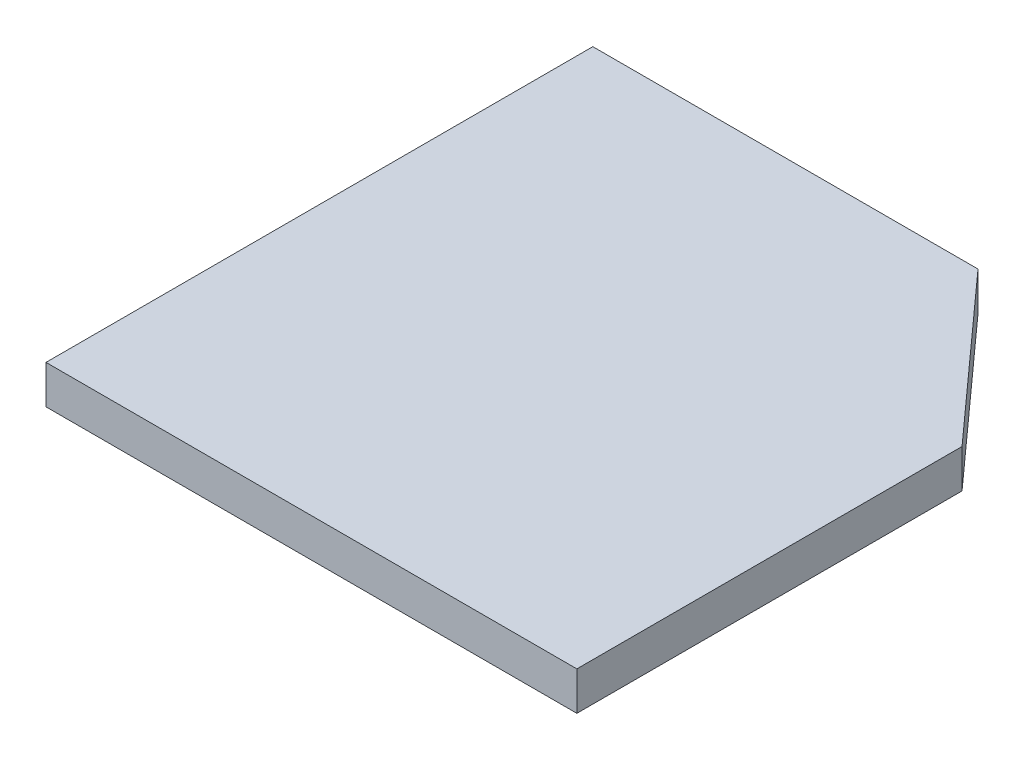
ISO-10303-21;
HEADER;
FILE_DESCRIPTION(('STEP AP214'),'2;1');
FILE_NAME('part.step','',(''),(''),'','','');
FILE_SCHEMA(('AUTOMOTIVE_DESIGN { 1 0 10303 214 1 1 1 1 }'));
ENDSEC;
DATA;
#1=APPLICATION_CONTEXT('core data for automotive mechanical design processes');
#2=APPLICATION_PROTOCOL_DEFINITION('international standard','automotive_design',2000,#1);
#3=PRODUCT_CONTEXT('',#1,'mechanical');
#4=PRODUCT('Part','Part','',(#3));
#5=PRODUCT_RELATED_PRODUCT_CATEGORY('part','',(#4));
#6=PRODUCT_DEFINITION_FORMATION('','',#4);
#7=PRODUCT_DEFINITION_CONTEXT('part definition',#1,'design');
#8=PRODUCT_DEFINITION('design','',#6,#7);
#9=PRODUCT_DEFINITION_SHAPE('','',#8);
#10=(LENGTH_UNIT() NAMED_UNIT(*) SI_UNIT(.MILLI.,.METRE.));
#11=(NAMED_UNIT(*) PLANE_ANGLE_UNIT() SI_UNIT($,.RADIAN.));
#12=(NAMED_UNIT(*) SI_UNIT($,.STERADIAN.) SOLID_ANGLE_UNIT());
#13=UNCERTAINTY_MEASURE_WITH_UNIT(LENGTH_MEASURE(1.E-05),#10,'distance_accuracy_value','');
#14=(GEOMETRIC_REPRESENTATION_CONTEXT(3) GLOBAL_UNCERTAINTY_ASSIGNED_CONTEXT((#13)) GLOBAL_UNIT_ASSIGNED_CONTEXT((#10,
#11,#12)) REPRESENTATION_CONTEXT('',''));
#15=CARTESIAN_POINT('',(0.,0.,0.));
#16=DIRECTION('',(0.,0.,1.));
#17=DIRECTION('',(1.,0.,0.));
#18=AXIS2_PLACEMENT_3D('',#15,#16,#17);
#19=CARTESIAN_POINT('',(0.,5.,0.));
#20=DIRECTION('',(1.,0.,0.));
#21=DIRECTION('',(0.,0.,-1.));
#22=AXIS2_PLACEMENT_3D('',#19,#20,#21);
#23=PLANE('',#22);
#24=DIRECTION('',(0.,0.,1.));
#25=VECTOR('',#24,1.);
#26=CARTESIAN_POINT('',(0.,0.,0.));
#27=LINE('',#26,#25);
#28=CARTESIAN_POINT('',(0.,0.,-70.9876663776316));
#29=VERTEX_POINT('',#28);
#30=CARTESIAN_POINT('',(0.,0.,0.));
#31=VERTEX_POINT('',#30);
#32=EDGE_CURVE('E119',#29,#31,#27,.T.);
#33=ORIENTED_EDGE('',*,*,#32,.T.);
#34=DIRECTION('',(0.,-1.,0.));
#35=VECTOR('',#34,1.);
#36=CARTESIAN_POINT('',(0.,5.,0.));
#37=LINE('',#36,#35);
#38=CARTESIAN_POINT('',(0.,5.,0.));
#39=VERTEX_POINT('',#38);
#40=EDGE_CURVE('E11',#39,#31,#37,.T.);
#41=ORIENTED_EDGE('',*,*,#40,.F.);
#42=DIRECTION('',(0.,0.,1.));
#43=VECTOR('',#42,1.);
#44=CARTESIAN_POINT('',(0.,5.,0.));
#45=LINE('',#44,#43);
#46=CARTESIAN_POINT('',(0.,5.,-70.9876663776316));
#47=VERTEX_POINT('',#46);
#48=EDGE_CURVE('E112',#47,#39,#45,.T.);
#49=ORIENTED_EDGE('',*,*,#48,.F.);
#50=DIRECTION('',(0.,-1.,0.));
#51=VECTOR('',#50,1.);
#52=CARTESIAN_POINT('',(0.,5.,-70.9876663776316));
#53=LINE('',#52,#51);
#54=EDGE_CURVE('E107',#47,#29,#53,.T.);
#55=ORIENTED_EDGE('',*,*,#54,.T.);
#56=EDGE_LOOP('',(#33,#41,#49,#55));
#57=FACE_BOUND('',#56,.T.);
#58=ADVANCED_FACE('F37',(#57),#23,.F.);
#59=CARTESIAN_POINT('',(0.,5.,0.));
#60=DIRECTION('',(0.,0.,-1.));
#61=DIRECTION('',(-1.,0.,0.));
#62=AXIS2_PLACEMENT_3D('',#59,#60,#61);
#63=PLANE('',#62);
#64=DIRECTION('',(1.,0.,0.));
#65=VECTOR('',#64,1.);
#66=CARTESIAN_POINT('',(0.,0.,0.));
#67=LINE('',#66,#65);
#68=CARTESIAN_POINT('',(68.9141987134367,0.,0.));
#69=VERTEX_POINT('',#68);
#70=EDGE_CURVE('E116',#31,#69,#67,.T.);
#71=ORIENTED_EDGE('',*,*,#70,.T.);
#72=DIRECTION('',(0.,-1.,0.));
#73=VECTOR('',#72,1.);
#74=CARTESIAN_POINT('',(68.9141987134367,5.,0.));
#75=LINE('',#74,#73);
#76=CARTESIAN_POINT('',(68.9141987134367,5.,0.));
#77=VERTEX_POINT('',#76);
#78=EDGE_CURVE('E45',#77,#69,#75,.T.);
#79=ORIENTED_EDGE('',*,*,#78,.F.);
#80=DIRECTION('',(1.,0.,0.));
#81=VECTOR('',#80,1.);
#82=CARTESIAN_POINT('',(0.,5.,0.));
#83=LINE('',#82,#81);
#84=EDGE_CURVE('E83',#39,#77,#83,.T.);
#85=ORIENTED_EDGE('',*,*,#84,.F.);
#86=ORIENTED_EDGE('',*,*,#40,.T.);
#87=EDGE_LOOP('',(#71,#79,#85,#86));
#88=FACE_BOUND('',#87,.T.);
#89=ADVANCED_FACE('F127',(#88),#63,.F.);
#90=CARTESIAN_POINT('',(68.9141987134367,5.,0.));
#91=DIRECTION('',(-1.,0.,0.));
#92=DIRECTION('',(0.,0.,1.));
#93=AXIS2_PLACEMENT_3D('',#90,#91,#92);
#94=PLANE('',#93);
#95=DIRECTION('',(0.,0.,-1.));
#96=VECTOR('',#95,1.);
#97=CARTESIAN_POINT('',(68.9141987134367,0.,0.));
#98=LINE('',#97,#96);
#99=CARTESIAN_POINT('',(68.9141987134367,0.,-50.));
#100=VERTEX_POINT('',#99);
#101=EDGE_CURVE('E105',#69,#100,#98,.T.);
#102=ORIENTED_EDGE('',*,*,#101,.T.);
#103=DIRECTION('',(0.,-1.,0.));
#104=VECTOR('',#103,1.);
#105=CARTESIAN_POINT('',(68.9141987134367,5.,-50.));
#106=LINE('',#105,#104);
#107=CARTESIAN_POINT('',(68.9141987134367,5.,-50.));
#108=VERTEX_POINT('',#107);
#109=EDGE_CURVE('E95',#108,#100,#106,.T.);
#110=ORIENTED_EDGE('',*,*,#109,.F.);
#111=DIRECTION('',(0.,0.,-1.));
#112=VECTOR('',#111,1.);
#113=CARTESIAN_POINT('',(68.9141987134367,5.,0.));
#114=LINE('',#113,#112);
#115=EDGE_CURVE('E98',#77,#108,#114,.T.);
#116=ORIENTED_EDGE('',*,*,#115,.F.);
#117=ORIENTED_EDGE('',*,*,#78,.T.);
#118=EDGE_LOOP('',(#102,#110,#116,#117));
#119=FACE_BOUND('',#118,.T.);
#120=ADVANCED_FACE('F104',(#119),#94,.F.);
#121=CARTESIAN_POINT('',(50.,5.,-70.9876663776316));
#122=DIRECTION('',(-0.742848732488238,0.,0.669459304693436));
#123=DIRECTION('',(0.669459304693436,0.,0.742848732488238));
#124=AXIS2_PLACEMENT_3D('',#121,#122,#123);
#125=PLANE('',#124);
#126=DIRECTION('',(-0.669459304693436,0.,-0.742848732488238));
#127=VECTOR('',#126,1.);
#128=CARTESIAN_POINT('',(50.,0.,-70.9876663776316));
#129=LINE('',#128,#127);
#130=CARTESIAN_POINT('',(50.,0.,-70.9876663776316));
#131=VERTEX_POINT('',#130);
#132=EDGE_CURVE('E113',#100,#131,#129,.T.);
#133=ORIENTED_EDGE('',*,*,#132,.T.);
#134=DIRECTION('',(0.,-1.,0.));
#135=VECTOR('',#134,1.);
#136=CARTESIAN_POINT('',(50.,5.,-70.9876663776316));
#137=LINE('',#136,#135);
#138=CARTESIAN_POINT('',(50.,5.,-70.9876663776316));
#139=VERTEX_POINT('',#138);
#140=EDGE_CURVE('E97',#139,#131,#137,.T.);
#141=ORIENTED_EDGE('',*,*,#140,.F.);
#142=DIRECTION('',(-0.669459304693436,0.,-0.742848732488238));
#143=VECTOR('',#142,1.);
#144=CARTESIAN_POINT('',(50.,5.,-70.9876663776316));
#145=LINE('',#144,#143);
#146=EDGE_CURVE('E90',#108,#139,#145,.T.);
#147=ORIENTED_EDGE('',*,*,#146,.F.);
#148=ORIENTED_EDGE('',*,*,#109,.T.);
#149=EDGE_LOOP('',(#133,#141,#147,#148));
#150=FACE_BOUND('',#149,.T.);
#151=ADVANCED_FACE('F93',(#150),#125,.F.);
#152=CARTESIAN_POINT('',(0.,5.,-70.9876663776316));
#153=DIRECTION('',(0.,0.,1.));
#154=DIRECTION('',(1.,0.,0.));
#155=AXIS2_PLACEMENT_3D('',#152,#153,#154);
#156=PLANE('',#155);
#157=DIRECTION('',(-1.,0.,0.));
#158=VECTOR('',#157,1.);
#159=CARTESIAN_POINT('',(0.,0.,-70.9876663776316));
#160=LINE('',#159,#158);
#161=EDGE_CURVE('E72',#131,#29,#160,.T.);
#162=ORIENTED_EDGE('',*,*,#161,.T.);
#163=ORIENTED_EDGE('',*,*,#54,.F.);
#164=DIRECTION('',(-1.,0.,0.));
#165=VECTOR('',#164,1.);
#166=CARTESIAN_POINT('',(0.,5.,-70.9876663776316));
#167=LINE('',#166,#165);
#168=EDGE_CURVE('E53',#139,#47,#167,.T.);
#169=ORIENTED_EDGE('',*,*,#168,.F.);
#170=ORIENTED_EDGE('',*,*,#140,.T.);
#171=EDGE_LOOP('',(#162,#163,#169,#170));
#172=FACE_BOUND('',#171,.T.);
#173=ADVANCED_FACE('F134',(#172),#156,.F.);
#174=CARTESIAN_POINT('',(0.,5.,0.));
#175=DIRECTION('',(0.,-1.,0.));
#176=DIRECTION('',(0.,0.,-1.));
#177=AXIS2_PLACEMENT_3D('',#174,#175,#176);
#178=PLANE('',#177);
#179=ORIENTED_EDGE('',*,*,#48,.T.);
#180=ORIENTED_EDGE('',*,*,#84,.T.);
#181=ORIENTED_EDGE('',*,*,#115,.T.);
#182=ORIENTED_EDGE('',*,*,#146,.T.);
#183=ORIENTED_EDGE('',*,*,#168,.T.);
#184=EDGE_LOOP('',(#179,#180,#181,#182,#183));
#185=FACE_BOUND('',#184,.T.);
#186=ADVANCED_FACE('F100',(#185),#178,.F.);
#187=CARTESIAN_POINT('',(0.,0.,0.));
#188=DIRECTION('',(0.,-1.,0.));
#189=DIRECTION('',(0.,0.,-1.));
#190=AXIS2_PLACEMENT_3D('',#187,#188,#189);
#191=PLANE('',#190);
#192=ORIENTED_EDGE('',*,*,#32,.F.);
#193=ORIENTED_EDGE('',*,*,#161,.F.);
#194=ORIENTED_EDGE('',*,*,#132,.F.);
#195=ORIENTED_EDGE('',*,*,#101,.F.);
#196=ORIENTED_EDGE('',*,*,#70,.F.);
#197=EDGE_LOOP('',(#192,#193,#194,#195,#196));
#198=FACE_BOUND('',#197,.T.);
#199=ADVANCED_FACE('F128',(#198),#191,.T.);
#200=CLOSED_SHELL('',(#58,#89,#120,#151,#173,#186,#199));
#201=MANIFOLD_SOLID_BREP('B2',#200);
#202=ADVANCED_BREP_SHAPE_REPRESENTATION('',(#18,#201),#14);
#203=SHAPE_DEFINITION_REPRESENTATION(#9,#202);
ENDSEC;
END-ISO-10303-21;
